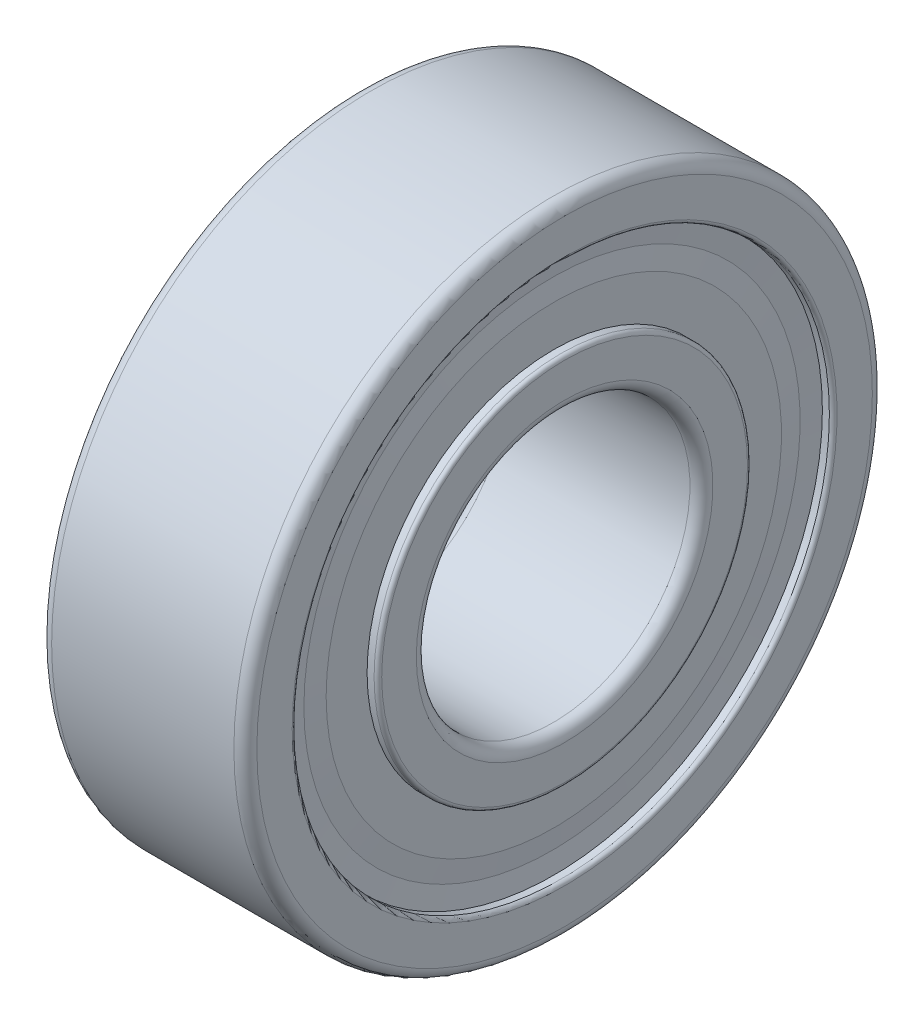
ISO-10303-21;
HEADER;
FILE_DESCRIPTION(('STEP AP214'),'2;1');
FILE_NAME('part.step','',(''),(''),'','','');
FILE_SCHEMA(('AUTOMOTIVE_DESIGN { 1 0 10303 214 1 1 1 1 }'));
ENDSEC;
DATA;
#1=APPLICATION_CONTEXT('core data for automotive mechanical design processes');
#2=APPLICATION_PROTOCOL_DEFINITION('international standard','automotive_design',2000,#1);
#3=PRODUCT_CONTEXT('',#1,'mechanical');
#4=PRODUCT('Part','Part','',(#3));
#5=PRODUCT_RELATED_PRODUCT_CATEGORY('part','',(#4));
#6=PRODUCT_DEFINITION_FORMATION('','',#4);
#7=PRODUCT_DEFINITION_CONTEXT('part definition',#1,'design');
#8=PRODUCT_DEFINITION('design','',#6,#7);
#9=PRODUCT_DEFINITION_SHAPE('','',#8);
#10=(LENGTH_UNIT() NAMED_UNIT(*) SI_UNIT(.MILLI.,.METRE.));
#11=(NAMED_UNIT(*) PLANE_ANGLE_UNIT() SI_UNIT($,.RADIAN.));
#12=(NAMED_UNIT(*) SI_UNIT($,.STERADIAN.) SOLID_ANGLE_UNIT());
#13=UNCERTAINTY_MEASURE_WITH_UNIT(LENGTH_MEASURE(1.E-05),#10,'distance_accuracy_value','');
#14=(GEOMETRIC_REPRESENTATION_CONTEXT(3) GLOBAL_UNCERTAINTY_ASSIGNED_CONTEXT((#13)) GLOBAL_UNIT_ASSIGNED_CONTEXT((#10,
#11,#12)) REPRESENTATION_CONTEXT('',''));
#15=CARTESIAN_POINT('',(0.,0.,0.));
#16=DIRECTION('',(0.,0.,1.));
#17=DIRECTION('',(1.,0.,0.));
#18=AXIS2_PLACEMENT_3D('',#15,#16,#17);
#19=CARTESIAN_POINT('',(6.74399999999994,0.,0.));
#20=DIRECTION('',(-1.,0.,0.));
#21=DIRECTION('',(0.,0.,1.));
#22=AXIS2_PLACEMENT_3D('',#19,#20,#21);
#23=TOROIDAL_SURFACE('',#22,5.16300000000007,0.400000000000065);
#24=CARTESIAN_POINT('',(6.744,0.,0.));
#25=DIRECTION('',(-1.,0.,0.));
#26=DIRECTION('',(0.,0.,1.));
#27=AXIS2_PLACEMENT_3D('',#24,#25,#26);
#28=CIRCLE('',#27,4.763);
#29=CARTESIAN_POINT('',(6.744,0.,4.763));
#30=VERTEX_POINT('',#29);
#31=EDGE_CURVE('E10',#30,#30,#28,.T.);
#32=ORIENTED_EDGE('',*,*,#31,.T.);
#33=EDGE_LOOP('',(#32));
#34=FACE_BOUND('',#33,.T.);
#35=CARTESIAN_POINT('',(7.144,0.,0.));
#36=DIRECTION('',(-1.,0.,0.));
#37=DIRECTION('',(0.,0.,1.));
#38=AXIS2_PLACEMENT_3D('',#35,#36,#37);
#39=CIRCLE('',#38,5.16300000000006);
#40=CARTESIAN_POINT('',(7.144,0.,5.16300000000006));
#41=VERTEX_POINT('',#40);
#42=EDGE_CURVE('E107',#41,#41,#39,.T.);
#43=ORIENTED_EDGE('',*,*,#42,.F.);
#44=EDGE_LOOP('',(#43));
#45=FACE_BOUND('',#44,.T.);
#46=ADVANCED_FACE('F31',(#34,#45),#23,.T.);
#47=CARTESIAN_POINT('',(7.14777159715007,0.,0.));
#48=DIRECTION('',(-1.,0.,0.));
#49=DIRECTION('',(0.,0.,1.));
#50=AXIS2_PLACEMENT_3D('',#47,#48,#49);
#51=CYLINDRICAL_SURFACE('',#50,4.763);
#52=CARTESIAN_POINT('',(0.399999999999999,0.,0.));
#53=DIRECTION('',(-1.,0.,0.));
#54=DIRECTION('',(0.,0.,1.));
#55=AXIS2_PLACEMENT_3D('',#52,#53,#54);
#56=CIRCLE('',#55,4.763);
#57=CARTESIAN_POINT('',(0.399999999999999,0.,4.763));
#58=VERTEX_POINT('',#57);
#59=EDGE_CURVE('E37',#58,#58,#56,.T.);
#60=ORIENTED_EDGE('',*,*,#59,.T.);
#61=EDGE_LOOP('',(#60));
#62=FACE_BOUND('',#61,.T.);
#63=ORIENTED_EDGE('',*,*,#31,.F.);
#64=EDGE_LOOP('',(#63));
#65=FACE_BOUND('',#64,.T.);
#66=ADVANCED_FACE('F115',(#62,#65),#51,.F.);
#67=CARTESIAN_POINT('',(0.40000000000003,0.,0.));
#68=DIRECTION('',(-1.,0.,0.));
#69=DIRECTION('',(0.,0.,1.));
#70=AXIS2_PLACEMENT_3D('',#67,#68,#69);
#71=TOROIDAL_SURFACE('',#70,5.16300000000003,0.400000000000031);
#72=CARTESIAN_POINT('',(0.,0.,0.));
#73=DIRECTION('',(-1.,0.,0.));
#74=DIRECTION('',(0.,0.,1.));
#75=AXIS2_PLACEMENT_3D('',#72,#73,#74);
#76=CIRCLE('',#75,5.16300000000002);
#77=CARTESIAN_POINT('',(0.,0.,5.16300000000002));
#78=VERTEX_POINT('',#77);
#79=EDGE_CURVE('E41',#78,#78,#76,.T.);
#80=ORIENTED_EDGE('',*,*,#79,.T.);
#81=EDGE_LOOP('',(#80));
#82=FACE_BOUND('',#81,.T.);
#83=ORIENTED_EDGE('',*,*,#59,.F.);
#84=EDGE_LOOP('',(#83));
#85=FACE_BOUND('',#84,.T.);
#86=ADVANCED_FACE('F119',(#82,#85),#71,.T.);
#87=CARTESIAN_POINT('',(0.,5.16300000000002,0.));
#88=DIRECTION('',(-1.,0.,0.));
#89=DIRECTION('',(0.,0.,1.));
#90=AXIS2_PLACEMENT_3D('',#87,#88,#89);
#91=PLANE('',#90);
#92=CARTESIAN_POINT('',(0.,0.,0.));
#93=DIRECTION('',(-1.,0.,0.));
#94=DIRECTION('',(0.,0.,1.));
#95=AXIS2_PLACEMENT_3D('',#92,#93,#94);
#96=CIRCLE('',#95,6.36700000000008);
#97=CARTESIAN_POINT('',(0.,0.,6.36700000000008));
#98=VERTEX_POINT('',#97);
#99=EDGE_CURVE('E45',#98,#98,#96,.T.);
#100=ORIENTED_EDGE('',*,*,#99,.T.);
#101=EDGE_LOOP('',(#100));
#102=FACE_BOUND('',#101,.T.);
#103=ORIENTED_EDGE('',*,*,#79,.F.);
#104=EDGE_LOOP('',(#103));
#105=FACE_BOUND('',#104,.T.);
#106=ADVANCED_FACE('F123',(#102,#105),#91,.T.);
#107=CARTESIAN_POINT('',(0.133000000000018,0.,0.));
#108=DIRECTION('',(-1.,0.,0.));
#109=DIRECTION('',(0.,0.,1.));
#110=AXIS2_PLACEMENT_3D('',#107,#108,#109);
#111=TOROIDAL_SURFACE('',#110,6.36699999999998,0.133000000000018);
#112=CARTESIAN_POINT('',(0.132999999999999,0.,0.));
#113=DIRECTION('',(-1.,0.,0.));
#114=DIRECTION('',(0.,0.,1.));
#115=AXIS2_PLACEMENT_3D('',#112,#113,#114);
#116=CIRCLE('',#115,6.5);
#117=CARTESIAN_POINT('',(0.132999999999999,0.,6.5));
#118=VERTEX_POINT('',#117);
#119=EDGE_CURVE('E50',#118,#118,#116,.T.);
#120=ORIENTED_EDGE('',*,*,#119,.T.);
#121=EDGE_LOOP('',(#120));
#122=FACE_BOUND('',#121,.T.);
#123=ORIENTED_EDGE('',*,*,#99,.F.);
#124=EDGE_LOOP('',(#123));
#125=FACE_BOUND('',#124,.T.);
#126=ADVANCED_FACE('F130',(#122,#125),#111,.T.);
#127=CARTESIAN_POINT('',(7.14777159715007,0.,0.));
#128=DIRECTION('',(-1.,0.,0.));
#129=DIRECTION('',(0.,0.,1.));
#130=AXIS2_PLACEMENT_3D('',#127,#128,#129);
#131=CYLINDRICAL_SURFACE('',#130,6.5);
#132=CARTESIAN_POINT('',(0.376,0.,0.));
#133=DIRECTION('',(-1.,0.,0.));
#134=DIRECTION('',(0.,0.,1.));
#135=AXIS2_PLACEMENT_3D('',#132,#133,#134);
#136=CIRCLE('',#135,6.5);
#137=CARTESIAN_POINT('',(0.376,0.,6.5));
#138=VERTEX_POINT('',#137);
#139=EDGE_CURVE('E53',#138,#138,#136,.T.);
#140=ORIENTED_EDGE('',*,*,#139,.T.);
#141=EDGE_LOOP('',(#140));
#142=FACE_BOUND('',#141,.T.);
#143=ORIENTED_EDGE('',*,*,#119,.F.);
#144=EDGE_LOOP('',(#143));
#145=FACE_BOUND('',#144,.T.);
#146=ADVANCED_FACE('F134',(#142,#145),#131,.T.);
#147=CARTESIAN_POINT('',(0.376,6.5,0.));
#148=DIRECTION('',(-1.,0.,0.));
#149=DIRECTION('',(0.,0.,1.));
#150=AXIS2_PLACEMENT_3D('',#147,#148,#149);
#151=PLANE('',#150);
#152=CARTESIAN_POINT('',(0.376,0.,0.));
#153=DIRECTION('',(-1.,0.,0.));
#154=DIRECTION('',(0.,0.,1.));
#155=AXIS2_PLACEMENT_3D('',#152,#153,#154);
#156=CIRCLE('',#155,7.925);
#157=CARTESIAN_POINT('',(0.376,0.,7.925));
#158=VERTEX_POINT('',#157);
#159=EDGE_CURVE('E56',#158,#158,#156,.T.);
#160=ORIENTED_EDGE('',*,*,#159,.T.);
#161=EDGE_LOOP('',(#160));
#162=FACE_BOUND('',#161,.T.);
#163=ORIENTED_EDGE('',*,*,#139,.F.);
#164=EDGE_LOOP('',(#163));
#165=FACE_BOUND('',#164,.T.);
#166=ADVANCED_FACE('F138',(#162,#165),#151,.T.);
#167=CARTESIAN_POINT('',(0.376,0.,0.));
#168=DIRECTION('',(1.,0.,0.));
#169=DIRECTION('',(0.,0.,-1.));
#170=AXIS2_PLACEMENT_3D('',#167,#168,#169);
#171=CONICAL_SURFACE('',#170,7.925,1.48295279871847);
#172=CARTESIAN_POINT('',(0.43875,0.,0.));
#173=DIRECTION('',(-1.,0.,0.));
#174=DIRECTION('',(0.,0.,1.));
#175=AXIS2_PLACEMENT_3D('',#172,#173,#174);
#176=CIRCLE('',#175,8.6375);
#177=CARTESIAN_POINT('',(0.43875,0.,8.6375));
#178=VERTEX_POINT('',#177);
#179=EDGE_CURVE('E59',#178,#178,#176,.T.);
#180=ORIENTED_EDGE('',*,*,#179,.T.);
#181=EDGE_LOOP('',(#180));
#182=FACE_BOUND('',#181,.T.);
#183=ORIENTED_EDGE('',*,*,#159,.F.);
#184=EDGE_LOOP('',(#183));
#185=FACE_BOUND('',#184,.T.);
#186=ADVANCED_FACE('F142',(#182,#185),#171,.T.);
#187=CARTESIAN_POINT('',(0.43875,0.,0.));
#188=DIRECTION('',(-1.,0.,0.));
#189=DIRECTION('',(0.,0.,1.));
#190=AXIS2_PLACEMENT_3D('',#187,#188,#189);
#191=CONICAL_SURFACE('',#190,8.6375,1.48295279871847);
#192=CARTESIAN_POINT('',(0.376,0.,0.));
#193=DIRECTION('',(-1.,0.,0.));
#194=DIRECTION('',(0.,0.,1.));
#195=AXIS2_PLACEMENT_3D('',#192,#193,#194);
#196=CIRCLE('',#195,9.35);
#197=CARTESIAN_POINT('',(0.376,0.,9.35));
#198=VERTEX_POINT('',#197);
#199=EDGE_CURVE('E62',#198,#198,#196,.T.);
#200=ORIENTED_EDGE('',*,*,#199,.T.);
#201=EDGE_LOOP('',(#200));
#202=FACE_BOUND('',#201,.T.);
#203=ORIENTED_EDGE('',*,*,#179,.F.);
#204=EDGE_LOOP('',(#203));
#205=FACE_BOUND('',#204,.T.);
#206=ADVANCED_FACE('F146',(#202,#205),#191,.F.);
#207=CARTESIAN_POINT('',(7.14777159715007,0.,0.));
#208=DIRECTION('',(-1.,0.,0.));
#209=DIRECTION('',(0.,0.,1.));
#210=AXIS2_PLACEMENT_3D('',#207,#208,#209);
#211=CYLINDRICAL_SURFACE('',#210,9.35);
#212=CARTESIAN_POINT('',(0.132999999999999,0.,0.));
#213=DIRECTION('',(-1.,0.,0.));
#214=DIRECTION('',(0.,0.,1.));
#215=AXIS2_PLACEMENT_3D('',#212,#213,#214);
#216=CIRCLE('',#215,9.35);
#217=CARTESIAN_POINT('',(0.132999999999999,0.,9.35));
#218=VERTEX_POINT('',#217);
#219=EDGE_CURVE('E65',#218,#218,#216,.T.);
#220=ORIENTED_EDGE('',*,*,#219,.T.);
#221=EDGE_LOOP('',(#220));
#222=FACE_BOUND('',#221,.T.);
#223=ORIENTED_EDGE('',*,*,#199,.F.);
#224=EDGE_LOOP('',(#223));
#225=FACE_BOUND('',#224,.T.);
#226=ADVANCED_FACE('F150',(#222,#225),#211,.F.);
#227=CARTESIAN_POINT('',(0.133000000000018,0.,0.));
#228=DIRECTION('',(-1.,0.,0.));
#229=DIRECTION('',(0.,0.,1.));
#230=AXIS2_PLACEMENT_3D('',#227,#228,#229);
#231=TOROIDAL_SURFACE('',#230,9.48300000000002,0.133000000000017);
#232=CARTESIAN_POINT('',(0.,0.,0.));
#233=DIRECTION('',(-1.,0.,0.));
#234=DIRECTION('',(0.,0.,1.));
#235=AXIS2_PLACEMENT_3D('',#232,#233,#234);
#236=CIRCLE('',#235,9.48300000000002);
#237=CARTESIAN_POINT('',(0.,0.,9.48300000000002));
#238=VERTEX_POINT('',#237);
#239=EDGE_CURVE('E68',#238,#238,#236,.T.);
#240=ORIENTED_EDGE('',*,*,#239,.T.);
#241=EDGE_LOOP('',(#240));
#242=FACE_BOUND('',#241,.T.);
#243=ORIENTED_EDGE('',*,*,#219,.F.);
#244=EDGE_LOOP('',(#243));
#245=FACE_BOUND('',#244,.T.);
#246=ADVANCED_FACE('F154',(#242,#245),#231,.T.);
#247=CARTESIAN_POINT('',(0.,9.48300000000002,0.));
#248=DIRECTION('',(-1.,0.,0.));
#249=DIRECTION('',(0.,0.,1.));
#250=AXIS2_PLACEMENT_3D('',#247,#248,#249);
#251=PLANE('',#250);
#252=CARTESIAN_POINT('',(0.,0.,0.));
#253=DIRECTION('',(-1.,0.,0.));
#254=DIRECTION('',(0.,0.,1.));
#255=AXIS2_PLACEMENT_3D('',#252,#253,#254);
#256=CIRCLE('',#255,10.7130000000007);
#257=CARTESIAN_POINT('',(0.,0.,10.7130000000007));
#258=VERTEX_POINT('',#257);
#259=EDGE_CURVE('E71',#258,#258,#256,.T.);
#260=ORIENTED_EDGE('',*,*,#259,.T.);
#261=EDGE_LOOP('',(#260));
#262=FACE_BOUND('',#261,.T.);
#263=ORIENTED_EDGE('',*,*,#239,.F.);
#264=EDGE_LOOP('',(#263));
#265=FACE_BOUND('',#264,.T.);
#266=ADVANCED_FACE('F158',(#262,#265),#251,.T.);
#267=CARTESIAN_POINT('',(0.399999999999349,0.,0.));
#268=DIRECTION('',(-1.,0.,0.));
#269=DIRECTION('',(0.,0.,1.));
#270=AXIS2_PLACEMENT_3D('',#267,#268,#269);
#271=TOROIDAL_SURFACE('',#270,10.7130000000007,0.399999999999349);
#272=CARTESIAN_POINT('',(0.399999999999348,0.,0.));
#273=DIRECTION('',(-1.,0.,0.));
#274=DIRECTION('',(0.,0.,1.));
#275=AXIS2_PLACEMENT_3D('',#272,#273,#274);
#276=CIRCLE('',#275,11.113);
#277=CARTESIAN_POINT('',(0.399999999999348,0.,11.113));
#278=VERTEX_POINT('',#277);
#279=EDGE_CURVE('E74',#278,#278,#276,.T.);
#280=ORIENTED_EDGE('',*,*,#279,.T.);
#281=EDGE_LOOP('',(#280));
#282=FACE_BOUND('',#281,.T.);
#283=ORIENTED_EDGE('',*,*,#259,.F.);
#284=EDGE_LOOP('',(#283));
#285=FACE_BOUND('',#284,.T.);
#286=ADVANCED_FACE('F162',(#282,#285),#271,.T.);
#287=CARTESIAN_POINT('',(7.14777159715007,0.,0.));
#288=DIRECTION('',(-1.,0.,0.));
#289=DIRECTION('',(0.,0.,1.));
#290=AXIS2_PLACEMENT_3D('',#287,#288,#289);
#291=CYLINDRICAL_SURFACE('',#290,11.113);
#292=CARTESIAN_POINT('',(6.74400000000062,0.,0.));
#293=DIRECTION('',(-1.,0.,0.));
#294=DIRECTION('',(0.,0.,1.));
#295=AXIS2_PLACEMENT_3D('',#292,#293,#294);
#296=CIRCLE('',#295,11.113);
#297=CARTESIAN_POINT('',(6.74400000000062,0.,11.113));
#298=VERTEX_POINT('',#297);
#299=EDGE_CURVE('E77',#298,#298,#296,.T.);
#300=ORIENTED_EDGE('',*,*,#299,.T.);
#301=EDGE_LOOP('',(#300));
#302=FACE_BOUND('',#301,.T.);
#303=ORIENTED_EDGE('',*,*,#279,.F.);
#304=EDGE_LOOP('',(#303));
#305=FACE_BOUND('',#304,.T.);
#306=ADVANCED_FACE('F166',(#302,#305),#291,.T.);
#307=CARTESIAN_POINT('',(6.74400000000062,0.,0.));
#308=DIRECTION('',(-1.,0.,0.));
#309=DIRECTION('',(0.,0.,1.));
#310=AXIS2_PLACEMENT_3D('',#307,#308,#309);
#311=TOROIDAL_SURFACE('',#310,10.7130000000006,0.399999999999383);
#312=CARTESIAN_POINT('',(7.144,0.,0.));
#313=DIRECTION('',(-1.,0.,0.));
#314=DIRECTION('',(0.,0.,1.));
#315=AXIS2_PLACEMENT_3D('',#312,#313,#314);
#316=CIRCLE('',#315,10.7130000000006);
#317=CARTESIAN_POINT('',(7.144,0.,10.7130000000006));
#318=VERTEX_POINT('',#317);
#319=EDGE_CURVE('E80',#318,#318,#316,.T.);
#320=ORIENTED_EDGE('',*,*,#319,.T.);
#321=EDGE_LOOP('',(#320));
#322=FACE_BOUND('',#321,.T.);
#323=ORIENTED_EDGE('',*,*,#299,.F.);
#324=EDGE_LOOP('',(#323));
#325=FACE_BOUND('',#324,.T.);
#326=ADVANCED_FACE('F170',(#322,#325),#311,.T.);
#327=CARTESIAN_POINT('',(7.144,10.7130000000006,0.));
#328=DIRECTION('',(1.,0.,0.));
#329=DIRECTION('',(0.,0.,-1.));
#330=AXIS2_PLACEMENT_3D('',#327,#328,#329);
#331=PLANE('',#330);
#332=CARTESIAN_POINT('',(7.144,0.,0.));
#333=DIRECTION('',(-1.,0.,0.));
#334=DIRECTION('',(0.,0.,1.));
#335=AXIS2_PLACEMENT_3D('',#332,#333,#334);
#336=CIRCLE('',#335,9.48300000000003);
#337=CARTESIAN_POINT('',(7.144,0.,9.48300000000003));
#338=VERTEX_POINT('',#337);
#339=EDGE_CURVE('E83',#338,#338,#336,.T.);
#340=ORIENTED_EDGE('',*,*,#339,.T.);
#341=EDGE_LOOP('',(#340));
#342=FACE_BOUND('',#341,.T.);
#343=ORIENTED_EDGE('',*,*,#319,.F.);
#344=EDGE_LOOP('',(#343));
#345=FACE_BOUND('',#344,.T.);
#346=ADVANCED_FACE('F174',(#342,#345),#331,.T.);
#347=CARTESIAN_POINT('',(7.01099999999997,0.,0.));
#348=DIRECTION('',(-1.,0.,0.));
#349=DIRECTION('',(0.,0.,1.));
#350=AXIS2_PLACEMENT_3D('',#347,#348,#349);
#351=TOROIDAL_SURFACE('',#350,9.48300000000004,0.133000000000035);
#352=CARTESIAN_POINT('',(7.011,0.,0.));
#353=DIRECTION('',(-1.,0.,0.));
#354=DIRECTION('',(0.,0.,1.));
#355=AXIS2_PLACEMENT_3D('',#352,#353,#354);
#356=CIRCLE('',#355,9.35);
#357=CARTESIAN_POINT('',(7.011,0.,9.35));
#358=VERTEX_POINT('',#357);
#359=EDGE_CURVE('E86',#358,#358,#356,.T.);
#360=ORIENTED_EDGE('',*,*,#359,.T.);
#361=EDGE_LOOP('',(#360));
#362=FACE_BOUND('',#361,.T.);
#363=ORIENTED_EDGE('',*,*,#339,.F.);
#364=EDGE_LOOP('',(#363));
#365=FACE_BOUND('',#364,.T.);
#366=ADVANCED_FACE('F178',(#362,#365),#351,.T.);
#367=CARTESIAN_POINT('',(7.14777159715007,0.,0.));
#368=DIRECTION('',(-1.,0.,0.));
#369=DIRECTION('',(0.,0.,1.));
#370=AXIS2_PLACEMENT_3D('',#367,#368,#369);
#371=CYLINDRICAL_SURFACE('',#370,9.35);
#372=CARTESIAN_POINT('',(6.768,0.,0.));
#373=DIRECTION('',(-1.,0.,0.));
#374=DIRECTION('',(0.,0.,1.));
#375=AXIS2_PLACEMENT_3D('',#372,#373,#374);
#376=CIRCLE('',#375,9.35);
#377=CARTESIAN_POINT('',(6.768,0.,9.35));
#378=VERTEX_POINT('',#377);
#379=EDGE_CURVE('E89',#378,#378,#376,.T.);
#380=ORIENTED_EDGE('',*,*,#379,.T.);
#381=EDGE_LOOP('',(#380));
#382=FACE_BOUND('',#381,.T.);
#383=ORIENTED_EDGE('',*,*,#359,.F.);
#384=EDGE_LOOP('',(#383));
#385=FACE_BOUND('',#384,.T.);
#386=ADVANCED_FACE('F182',(#382,#385),#371,.F.);
#387=CARTESIAN_POINT('',(6.768,0.,0.));
#388=DIRECTION('',(1.,0.,0.));
#389=DIRECTION('',(0.,0.,-1.));
#390=AXIS2_PLACEMENT_3D('',#387,#388,#389);
#391=CONICAL_SURFACE('',#390,9.35,1.48295279871846);
#392=CARTESIAN_POINT('',(6.70525,0.,0.));
#393=DIRECTION('',(-1.,0.,0.));
#394=DIRECTION('',(0.,0.,1.));
#395=AXIS2_PLACEMENT_3D('',#392,#393,#394);
#396=CIRCLE('',#395,8.63750000000001);
#397=CARTESIAN_POINT('',(6.70525,0.,8.63750000000001));
#398=VERTEX_POINT('',#397);
#399=EDGE_CURVE('E92',#398,#398,#396,.T.);
#400=ORIENTED_EDGE('',*,*,#399,.T.);
#401=EDGE_LOOP('',(#400));
#402=FACE_BOUND('',#401,.T.);
#403=ORIENTED_EDGE('',*,*,#379,.F.);
#404=EDGE_LOOP('',(#403));
#405=FACE_BOUND('',#404,.T.);
#406=ADVANCED_FACE('F186',(#402,#405),#391,.F.);
#407=CARTESIAN_POINT('',(6.70525,0.,0.));
#408=DIRECTION('',(-1.,0.,0.));
#409=DIRECTION('',(0.,0.,1.));
#410=AXIS2_PLACEMENT_3D('',#407,#408,#409);
#411=CONICAL_SURFACE('',#410,8.63750000000001,1.48295279871847);
#412=CARTESIAN_POINT('',(6.768,0.,0.));
#413=DIRECTION('',(-1.,0.,0.));
#414=DIRECTION('',(0.,0.,1.));
#415=AXIS2_PLACEMENT_3D('',#412,#413,#414);
#416=CIRCLE('',#415,7.92500000000001);
#417=CARTESIAN_POINT('',(6.768,0.,7.92500000000001));
#418=VERTEX_POINT('',#417);
#419=EDGE_CURVE('E95',#418,#418,#416,.T.);
#420=ORIENTED_EDGE('',*,*,#419,.T.);
#421=EDGE_LOOP('',(#420));
#422=FACE_BOUND('',#421,.T.);
#423=ORIENTED_EDGE('',*,*,#399,.F.);
#424=EDGE_LOOP('',(#423));
#425=FACE_BOUND('',#424,.T.);
#426=ADVANCED_FACE('F190',(#422,#425),#411,.T.);
#427=CARTESIAN_POINT('',(6.768,7.92500000000001,0.));
#428=DIRECTION('',(1.,0.,0.));
#429=DIRECTION('',(0.,0.,-1.));
#430=AXIS2_PLACEMENT_3D('',#427,#428,#429);
#431=PLANE('',#430);
#432=CARTESIAN_POINT('',(6.768,0.,0.));
#433=DIRECTION('',(-1.,0.,0.));
#434=DIRECTION('',(0.,0.,1.));
#435=AXIS2_PLACEMENT_3D('',#432,#433,#434);
#436=CIRCLE('',#435,6.5);
#437=CARTESIAN_POINT('',(6.768,0.,6.5));
#438=VERTEX_POINT('',#437);
#439=EDGE_CURVE('E98',#438,#438,#436,.T.);
#440=ORIENTED_EDGE('',*,*,#439,.T.);
#441=EDGE_LOOP('',(#440));
#442=FACE_BOUND('',#441,.T.);
#443=ORIENTED_EDGE('',*,*,#419,.F.);
#444=EDGE_LOOP('',(#443));
#445=FACE_BOUND('',#444,.T.);
#446=ADVANCED_FACE('F194',(#442,#445),#431,.T.);
#447=CARTESIAN_POINT('',(7.14777159715007,0.,0.));
#448=DIRECTION('',(-1.,0.,0.));
#449=DIRECTION('',(0.,0.,1.));
#450=AXIS2_PLACEMENT_3D('',#447,#448,#449);
#451=CYLINDRICAL_SURFACE('',#450,6.5);
#452=CARTESIAN_POINT('',(7.011,0.,0.));
#453=DIRECTION('',(-1.,0.,0.));
#454=DIRECTION('',(0.,0.,1.));
#455=AXIS2_PLACEMENT_3D('',#452,#453,#454);
#456=CIRCLE('',#455,6.5);
#457=CARTESIAN_POINT('',(7.011,0.,6.5));
#458=VERTEX_POINT('',#457);
#459=EDGE_CURVE('E101',#458,#458,#456,.T.);
#460=ORIENTED_EDGE('',*,*,#459,.T.);
#461=EDGE_LOOP('',(#460));
#462=FACE_BOUND('',#461,.T.);
#463=ORIENTED_EDGE('',*,*,#439,.F.);
#464=EDGE_LOOP('',(#463));
#465=FACE_BOUND('',#464,.T.);
#466=ADVANCED_FACE('F198',(#462,#465),#451,.T.);
#467=CARTESIAN_POINT('',(7.01099999999997,0.,0.));
#468=DIRECTION('',(-1.,0.,0.));
#469=DIRECTION('',(0.,0.,1.));
#470=AXIS2_PLACEMENT_3D('',#467,#468,#469);
#471=TOROIDAL_SURFACE('',#470,6.36699999999996,0.133000000000036);
#472=CARTESIAN_POINT('',(7.144,0.,0.));
#473=DIRECTION('',(-1.,0.,0.));
#474=DIRECTION('',(0.,0.,1.));
#475=AXIS2_PLACEMENT_3D('',#472,#473,#474);
#476=CIRCLE('',#475,6.367);
#477=CARTESIAN_POINT('',(7.144,0.,6.367));
#478=VERTEX_POINT('',#477);
#479=EDGE_CURVE('E104',#478,#478,#476,.T.);
#480=ORIENTED_EDGE('',*,*,#479,.T.);
#481=EDGE_LOOP('',(#480));
#482=FACE_BOUND('',#481,.T.);
#483=ORIENTED_EDGE('',*,*,#459,.F.);
#484=EDGE_LOOP('',(#483));
#485=FACE_BOUND('',#484,.T.);
#486=ADVANCED_FACE('F202',(#482,#485),#471,.T.);
#487=CARTESIAN_POINT('',(7.144,6.367,0.));
#488=DIRECTION('',(1.,0.,0.));
#489=DIRECTION('',(0.,0.,-1.));
#490=AXIS2_PLACEMENT_3D('',#487,#488,#489);
#491=PLANE('',#490);
#492=ORIENTED_EDGE('',*,*,#42,.T.);
#493=EDGE_LOOP('',(#492));
#494=FACE_BOUND('',#493,.T.);
#495=ORIENTED_EDGE('',*,*,#479,.F.);
#496=EDGE_LOOP('',(#495));
#497=FACE_BOUND('',#496,.T.);
#498=ADVANCED_FACE('F111',(#494,#497),#491,.T.);
#499=CLOSED_SHELL('',(#46,#66,#86,#106,#126,#146,#166,#186,#206,#226,#246,#266,#286,#306,#326,
#346,#366,#386,#406,#426,#446,#466,#486,#498));
#500=MANIFOLD_SOLID_BREP('B2',#499);
#501=ADVANCED_BREP_SHAPE_REPRESENTATION('',(#18,#500),#14);
#502=SHAPE_DEFINITION_REPRESENTATION(#9,#501);
ENDSEC;
END-ISO-10303-21;
